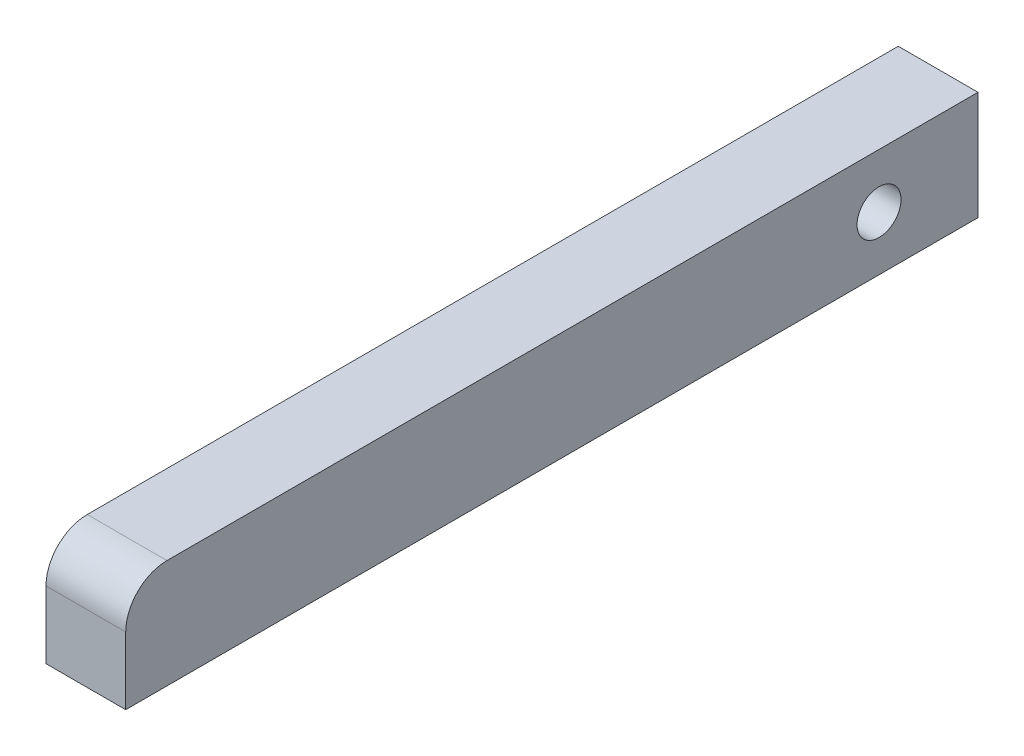
ISO-10303-21;
HEADER;
FILE_DESCRIPTION(('STEP AP214'),'2;1');
FILE_NAME('part.step','',(''),(''),'','','');
FILE_SCHEMA(('AUTOMOTIVE_DESIGN { 1 0 10303 214 1 1 1 1 }'));
ENDSEC;
DATA;
#1=APPLICATION_CONTEXT('core data for automotive mechanical design processes');
#2=APPLICATION_PROTOCOL_DEFINITION('international standard','automotive_design',2000,#1);
#3=PRODUCT_CONTEXT('',#1,'mechanical');
#4=PRODUCT('Part','Part','',(#3));
#5=PRODUCT_RELATED_PRODUCT_CATEGORY('part','',(#4));
#6=PRODUCT_DEFINITION_FORMATION('','',#4);
#7=PRODUCT_DEFINITION_CONTEXT('part definition',#1,'design');
#8=PRODUCT_DEFINITION('design','',#6,#7);
#9=PRODUCT_DEFINITION_SHAPE('','',#8);
#10=(LENGTH_UNIT() NAMED_UNIT(*) SI_UNIT(.MILLI.,.METRE.));
#11=(NAMED_UNIT(*) PLANE_ANGLE_UNIT() SI_UNIT($,.RADIAN.));
#12=(NAMED_UNIT(*) SI_UNIT($,.STERADIAN.) SOLID_ANGLE_UNIT());
#13=UNCERTAINTY_MEASURE_WITH_UNIT(LENGTH_MEASURE(1.E-05),#10,'distance_accuracy_value','');
#14=(GEOMETRIC_REPRESENTATION_CONTEXT(3) GLOBAL_UNCERTAINTY_ASSIGNED_CONTEXT((#13)) GLOBAL_UNIT_ASSIGNED_CONTEXT((#10,
#11,#12)) REPRESENTATION_CONTEXT('',''));
#15=CARTESIAN_POINT('',(0.,0.,0.));
#16=DIRECTION('',(0.,0.,1.));
#17=DIRECTION('',(1.,0.,0.));
#18=AXIS2_PLACEMENT_3D('',#15,#16,#17);
#19=CARTESIAN_POINT('',(2.9,-3.95,62.));
#20=DIRECTION('',(-1.,0.,0.));
#21=DIRECTION('',(0.,0.,1.));
#22=AXIS2_PLACEMENT_3D('',#19,#20,#21);
#23=PLANE('',#22);
#24=CARTESIAN_POINT('',(2.9,0.,7.2));
#25=DIRECTION('',(1.,0.,0.));
#26=DIRECTION('',(0.,0.,-1.));
#27=AXIS2_PLACEMENT_3D('',#24,#25,#26);
#28=CIRCLE('',#27,1.6);
#29=CARTESIAN_POINT('',(2.9,0.,5.6));
#30=VERTEX_POINT('',#29);
#31=EDGE_CURVE('E152',#30,#30,#28,.T.);
#32=ORIENTED_EDGE('',*,*,#31,.F.);
#33=EDGE_LOOP('',(#32));
#34=FACE_BOUND('',#33,.T.);
#35=DIRECTION('',(0.,0.,-1.));
#36=VECTOR('',#35,1.);
#37=CARTESIAN_POINT('',(2.9,3.95,62.));
#38=LINE('',#37,#36);
#39=CARTESIAN_POINT('',(2.9,3.95,59.));
#40=VERTEX_POINT('',#39);
#41=CARTESIAN_POINT('',(2.9,3.95,0.));
#42=VERTEX_POINT('',#41);
#43=EDGE_CURVE('E136',#40,#42,#38,.T.);
#44=ORIENTED_EDGE('',*,*,#43,.F.);
#45=CARTESIAN_POINT('',(2.9,0.95,59.));
#46=DIRECTION('',(-1.,0.,0.));
#47=DIRECTION('',(0.,0.,1.));
#48=AXIS2_PLACEMENT_3D('',#45,#46,#47);
#49=CIRCLE('',#48,3.);
#50=CARTESIAN_POINT('',(2.9,0.95,62.));
#51=VERTEX_POINT('',#50);
#52=EDGE_CURVE('E11',#40,#51,#49,.F.);
#53=ORIENTED_EDGE('',*,*,#52,.T.);
#54=DIRECTION('',(0.,1.,0.));
#55=VECTOR('',#54,1.);
#56=CARTESIAN_POINT('',(2.9,-3.95,62.));
#57=LINE('',#56,#55);
#58=CARTESIAN_POINT('',(2.9,-3.95,62.));
#59=VERTEX_POINT('',#58);
#60=EDGE_CURVE('E98',#59,#51,#57,.T.);
#61=ORIENTED_EDGE('',*,*,#60,.F.);
#62=DIRECTION('',(0.,0.,-1.));
#63=VECTOR('',#62,1.);
#64=CARTESIAN_POINT('',(2.9,-3.95,62.));
#65=LINE('',#64,#63);
#66=CARTESIAN_POINT('',(2.9,-3.95,0.));
#67=VERTEX_POINT('',#66);
#68=EDGE_CURVE('E109',#59,#67,#65,.T.);
#69=ORIENTED_EDGE('',*,*,#68,.T.);
#70=DIRECTION('',(0.,1.,0.));
#71=VECTOR('',#70,1.);
#72=CARTESIAN_POINT('',(2.9,-3.95,0.));
#73=LINE('',#72,#71);
#74=EDGE_CURVE('E120',#67,#42,#73,.T.);
#75=ORIENTED_EDGE('',*,*,#74,.T.);
#76=EDGE_LOOP('',(#44,#53,#61,#69,#75));
#77=FACE_BOUND('',#76,.T.);
#78=ADVANCED_FACE('F43',(#34,#77),#23,.F.);
#79=CARTESIAN_POINT('',(-2.9,3.95,62.));
#80=DIRECTION('',(0.,-1.,0.));
#81=DIRECTION('',(0.,0.,-1.));
#82=AXIS2_PLACEMENT_3D('',#79,#80,#81);
#83=PLANE('',#82);
#84=DIRECTION('',(0.,0.,-1.));
#85=VECTOR('',#84,1.);
#86=CARTESIAN_POINT('',(-2.9,3.95,62.));
#87=LINE('',#86,#85);
#88=CARTESIAN_POINT('',(-2.9,3.95,59.));
#89=VERTEX_POINT('',#88);
#90=CARTESIAN_POINT('',(-2.9,3.95,0.));
#91=VERTEX_POINT('',#90);
#92=EDGE_CURVE('E108',#89,#91,#87,.T.);
#93=ORIENTED_EDGE('',*,*,#92,.F.);
#94=DIRECTION('',(-1.,0.,0.));
#95=VECTOR('',#94,1.);
#96=CARTESIAN_POINT('',(-2.9,3.95,59.));
#97=LINE('',#96,#95);
#98=EDGE_CURVE('E52',#89,#40,#97,.F.);
#99=ORIENTED_EDGE('',*,*,#98,.T.);
#100=ORIENTED_EDGE('',*,*,#43,.T.);
#101=DIRECTION('',(-1.,0.,0.));
#102=VECTOR('',#101,1.);
#103=CARTESIAN_POINT('',(-2.9,3.95,0.));
#104=LINE('',#103,#102);
#105=EDGE_CURVE('E124',#42,#91,#104,.T.);
#106=ORIENTED_EDGE('',*,*,#105,.T.);
#107=EDGE_LOOP('',(#93,#99,#100,#106));
#108=FACE_BOUND('',#107,.T.);
#109=ADVANCED_FACE('F144',(#108),#83,.F.);
#110=CARTESIAN_POINT('',(-2.9,-3.95,62.));
#111=DIRECTION('',(1.,0.,0.));
#112=DIRECTION('',(0.,0.,-1.));
#113=AXIS2_PLACEMENT_3D('',#110,#111,#112);
#114=PLANE('',#113);
#115=CARTESIAN_POINT('',(-2.9,0.,7.2));
#116=DIRECTION('',(1.,0.,0.));
#117=DIRECTION('',(0.,0.,-1.));
#118=AXIS2_PLACEMENT_3D('',#115,#116,#117);
#119=CIRCLE('',#118,1.6);
#120=CARTESIAN_POINT('',(-2.9,0.,5.6));
#121=VERTEX_POINT('',#120);
#122=EDGE_CURVE('E125',#121,#121,#119,.T.);
#123=ORIENTED_EDGE('',*,*,#122,.T.);
#124=EDGE_LOOP('',(#123));
#125=FACE_BOUND('',#124,.T.);
#126=DIRECTION('',(0.,-1.,0.));
#127=VECTOR('',#126,1.);
#128=CARTESIAN_POINT('',(-2.9,-3.95,62.));
#129=LINE('',#128,#127);
#130=CARTESIAN_POINT('',(-2.9,0.95,62.));
#131=VERTEX_POINT('',#130);
#132=CARTESIAN_POINT('',(-2.9,-3.95,62.));
#133=VERTEX_POINT('',#132);
#134=EDGE_CURVE('E88',#131,#133,#129,.T.);
#135=ORIENTED_EDGE('',*,*,#134,.F.);
#136=CARTESIAN_POINT('',(-2.9,0.95,59.));
#137=DIRECTION('',(1.,0.,0.));
#138=DIRECTION('',(0.,0.,-1.));
#139=AXIS2_PLACEMENT_3D('',#136,#137,#138);
#140=CIRCLE('',#139,3.);
#141=EDGE_CURVE('E66',#131,#89,#140,.F.);
#142=ORIENTED_EDGE('',*,*,#141,.T.);
#143=ORIENTED_EDGE('',*,*,#92,.T.);
#144=DIRECTION('',(0.,-1.,0.));
#145=VECTOR('',#144,1.);
#146=CARTESIAN_POINT('',(-2.9,-3.95,0.));
#147=LINE('',#146,#145);
#148=CARTESIAN_POINT('',(-2.9,-3.95,0.));
#149=VERTEX_POINT('',#148);
#150=EDGE_CURVE('E104',#91,#149,#147,.T.);
#151=ORIENTED_EDGE('',*,*,#150,.T.);
#152=DIRECTION('',(0.,0.,-1.));
#153=VECTOR('',#152,1.);
#154=CARTESIAN_POINT('',(-2.9,-3.95,62.));
#155=LINE('',#154,#153);
#156=EDGE_CURVE('E101',#133,#149,#155,.T.);
#157=ORIENTED_EDGE('',*,*,#156,.F.);
#158=EDGE_LOOP('',(#135,#142,#143,#151,#157));
#159=FACE_BOUND('',#158,.T.);
#160=ADVANCED_FACE('F102',(#125,#159),#114,.F.);
#161=CARTESIAN_POINT('',(-2.9,-3.95,62.));
#162=DIRECTION('',(0.,1.,0.));
#163=DIRECTION('',(0.,0.,1.));
#164=AXIS2_PLACEMENT_3D('',#161,#162,#163);
#165=PLANE('',#164);
#166=DIRECTION('',(1.,0.,0.));
#167=VECTOR('',#166,1.);
#168=CARTESIAN_POINT('',(-2.9,-3.95,0.));
#169=LINE('',#168,#167);
#170=EDGE_CURVE('E131',#149,#67,#169,.T.);
#171=ORIENTED_EDGE('',*,*,#170,.T.);
#172=ORIENTED_EDGE('',*,*,#68,.F.);
#173=DIRECTION('',(1.,0.,0.));
#174=VECTOR('',#173,1.);
#175=CARTESIAN_POINT('',(-2.9,-3.95,62.));
#176=LINE('',#175,#174);
#177=EDGE_CURVE('E93',#133,#59,#176,.T.);
#178=ORIENTED_EDGE('',*,*,#177,.F.);
#179=ORIENTED_EDGE('',*,*,#156,.T.);
#180=EDGE_LOOP('',(#171,#172,#178,#179));
#181=FACE_BOUND('',#180,.T.);
#182=ADVANCED_FACE('F111',(#181),#165,.F.);
#183=CARTESIAN_POINT('',(0.,0.,62.));
#184=DIRECTION('',(0.,0.,-1.));
#185=DIRECTION('',(-1.,0.,0.));
#186=AXIS2_PLACEMENT_3D('',#183,#184,#185);
#187=PLANE('',#186);
#188=ORIENTED_EDGE('',*,*,#60,.T.);
#189=DIRECTION('',(-1.,0.,0.));
#190=VECTOR('',#189,1.);
#191=CARTESIAN_POINT('',(0.,0.95,62.));
#192=LINE('',#191,#190);
#193=EDGE_CURVE('E96',#51,#131,#192,.T.);
#194=ORIENTED_EDGE('',*,*,#193,.T.);
#195=ORIENTED_EDGE('',*,*,#134,.T.);
#196=ORIENTED_EDGE('',*,*,#177,.T.);
#197=EDGE_LOOP('',(#188,#194,#195,#196));
#198=FACE_BOUND('',#197,.T.);
#199=ADVANCED_FACE('F91',(#198),#187,.F.);
#200=CARTESIAN_POINT('',(0.,0.,0.));
#201=DIRECTION('',(0.,0.,-1.));
#202=DIRECTION('',(-1.,0.,0.));
#203=AXIS2_PLACEMENT_3D('',#200,#201,#202);
#204=PLANE('',#203);
#205=ORIENTED_EDGE('',*,*,#74,.F.);
#206=ORIENTED_EDGE('',*,*,#170,.F.);
#207=ORIENTED_EDGE('',*,*,#150,.F.);
#208=ORIENTED_EDGE('',*,*,#105,.F.);
#209=EDGE_LOOP('',(#205,#206,#207,#208));
#210=FACE_BOUND('',#209,.T.);
#211=ADVANCED_FACE('F149',(#210),#204,.T.);
#212=CARTESIAN_POINT('',(-2.9,0.,7.2));
#213=DIRECTION('',(1.,0.,0.));
#214=DIRECTION('',(0.,0.,-1.));
#215=AXIS2_PLACEMENT_3D('',#212,#213,#214);
#216=CYLINDRICAL_SURFACE('',#215,1.6);
#217=ORIENTED_EDGE('',*,*,#122,.F.);
#218=EDGE_LOOP('',(#217));
#219=FACE_BOUND('',#218,.T.);
#220=ORIENTED_EDGE('',*,*,#31,.T.);
#221=EDGE_LOOP('',(#220));
#222=FACE_BOUND('',#221,.T.);
#223=ADVANCED_FACE('F161',(#219,#222),#216,.F.);
#224=CARTESIAN_POINT('',(0.,0.95,59.));
#225=DIRECTION('',(-1.,0.,0.));
#226=DIRECTION('',(0.,0.,1.));
#227=AXIS2_PLACEMENT_3D('',#224,#225,#226);
#228=CYLINDRICAL_SURFACE('',#227,3.);
#229=ORIENTED_EDGE('',*,*,#52,.F.);
#230=ORIENTED_EDGE('',*,*,#98,.F.);
#231=ORIENTED_EDGE('',*,*,#141,.F.);
#232=ORIENTED_EDGE('',*,*,#193,.F.);
#233=EDGE_LOOP('',(#229,#230,#231,#232));
#234=FACE_BOUND('',#233,.T.);
#235=ADVANCED_FACE('F45',(#234),#228,.T.);
#236=CLOSED_SHELL('',(#78,#109,#160,#182,#199,#211,#223,#235));
#237=MANIFOLD_SOLID_BREP('B2',#236);
#238=ADVANCED_BREP_SHAPE_REPRESENTATION('',(#18,#237),#14);
#239=SHAPE_DEFINITION_REPRESENTATION(#9,#238);
ENDSEC;
END-ISO-10303-21;
